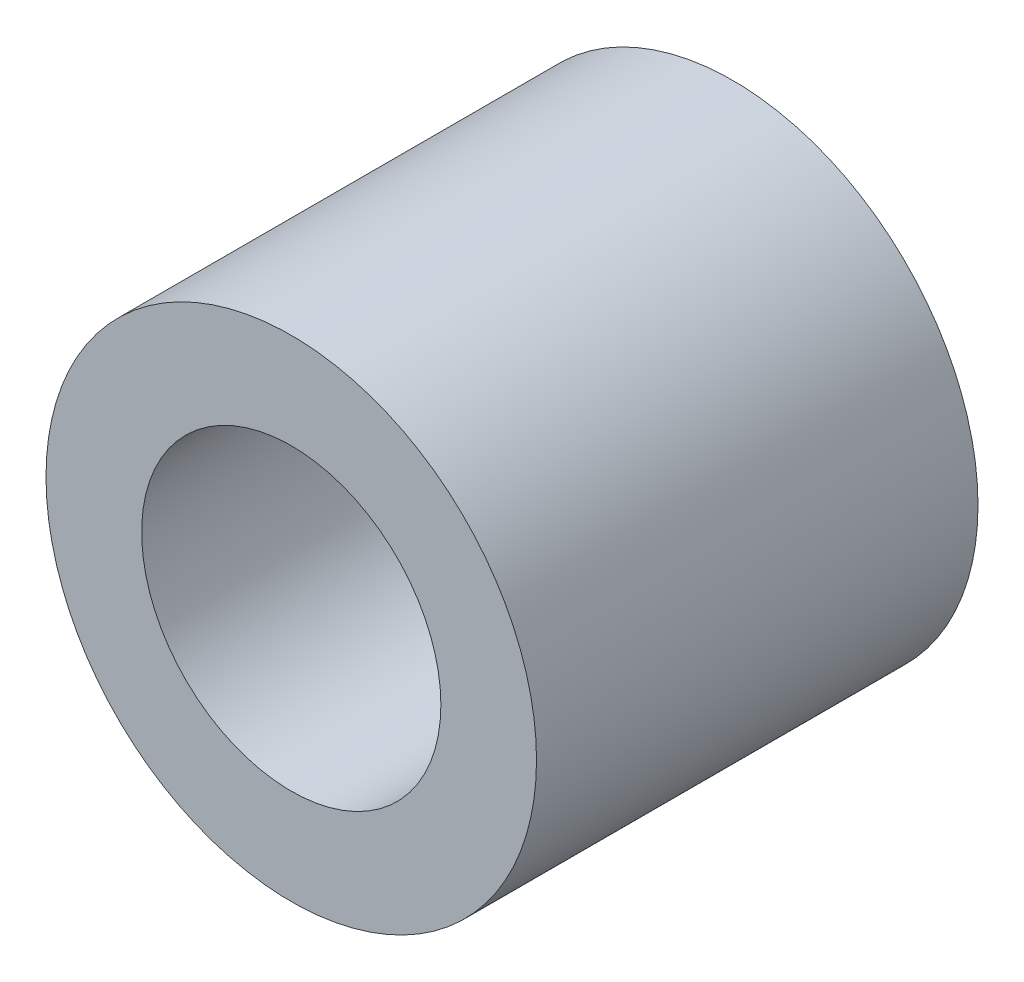
ISO-10303-21;
HEADER;
FILE_DESCRIPTION(('STEP AP214'),'2;1');
FILE_NAME('part.step','',(''),(''),'','','');
FILE_SCHEMA(('AUTOMOTIVE_DESIGN { 1 0 10303 214 1 1 1 1 }'));
ENDSEC;
DATA;
#1=APPLICATION_CONTEXT('core data for automotive mechanical design processes');
#2=APPLICATION_PROTOCOL_DEFINITION('international standard','automotive_design',2000,#1);
#3=PRODUCT_CONTEXT('',#1,'mechanical');
#4=PRODUCT('Part','Part','',(#3));
#5=PRODUCT_RELATED_PRODUCT_CATEGORY('part','',(#4));
#6=PRODUCT_DEFINITION_FORMATION('','',#4);
#7=PRODUCT_DEFINITION_CONTEXT('part definition',#1,'design');
#8=PRODUCT_DEFINITION('design','',#6,#7);
#9=PRODUCT_DEFINITION_SHAPE('','',#8);
#10=(LENGTH_UNIT() NAMED_UNIT(*) SI_UNIT(.MILLI.,.METRE.));
#11=(NAMED_UNIT(*) PLANE_ANGLE_UNIT() SI_UNIT($,.RADIAN.));
#12=(NAMED_UNIT(*) SI_UNIT($,.STERADIAN.) SOLID_ANGLE_UNIT());
#13=UNCERTAINTY_MEASURE_WITH_UNIT(LENGTH_MEASURE(1.E-05),#10,'distance_accuracy_value','');
#14=(GEOMETRIC_REPRESENTATION_CONTEXT(3) GLOBAL_UNCERTAINTY_ASSIGNED_CONTEXT((#13)) GLOBAL_UNIT_ASSIGNED_CONTEXT((#10,
#11,#12)) REPRESENTATION_CONTEXT('',''));
#15=CARTESIAN_POINT('',(0.,0.,0.));
#16=DIRECTION('',(0.,0.,1.));
#17=DIRECTION('',(1.,0.,0.));
#18=AXIS2_PLACEMENT_3D('',#15,#16,#17);
#19=CARTESIAN_POINT('',(0.,0.,9.));
#20=DIRECTION('',(0.,0.,1.));
#21=DIRECTION('',(1.,0.,0.));
#22=AXIS2_PLACEMENT_3D('',#19,#20,#21);
#23=PLANE('',#22);
#24=CARTESIAN_POINT('',(0.,0.,9.));
#25=DIRECTION('',(0.,0.,1.));
#26=DIRECTION('',(1.,0.,0.));
#27=AXIS2_PLACEMENT_3D('',#24,#25,#26);
#28=CIRCLE('',#27,5.);
#29=CARTESIAN_POINT('',(5.,0.,9.));
#30=VERTEX_POINT('',#29);
#31=EDGE_CURVE('E10',#30,#30,#28,.T.);
#32=ORIENTED_EDGE('',*,*,#31,.T.);
#33=EDGE_LOOP('',(#32));
#34=FACE_BOUND('',#33,.T.);
#35=CARTESIAN_POINT('',(0.,0.,9.));
#36=DIRECTION('',(0.,0.,1.));
#37=DIRECTION('',(1.,0.,0.));
#38=AXIS2_PLACEMENT_3D('',#35,#36,#37);
#39=CIRCLE('',#38,3.05);
#40=CARTESIAN_POINT('',(3.05,0.,9.));
#41=VERTEX_POINT('',#40);
#42=EDGE_CURVE('E44',#41,#41,#39,.T.);
#43=ORIENTED_EDGE('',*,*,#42,.F.);
#44=EDGE_LOOP('',(#43));
#45=FACE_BOUND('',#44,.T.);
#46=ADVANCED_FACE('F33',(#34,#45),#23,.T.);
#47=CARTESIAN_POINT('',(0.,0.,0.));
#48=DIRECTION('',(0.,0.,1.));
#49=DIRECTION('',(1.,0.,0.));
#50=AXIS2_PLACEMENT_3D('',#47,#48,#49);
#51=PLANE('',#50);
#52=CARTESIAN_POINT('',(0.,0.,0.));
#53=DIRECTION('',(0.,0.,1.));
#54=DIRECTION('',(1.,0.,0.));
#55=AXIS2_PLACEMENT_3D('',#52,#53,#54);
#56=CIRCLE('',#55,5.);
#57=CARTESIAN_POINT('',(5.,0.,0.));
#58=VERTEX_POINT('',#57);
#59=EDGE_CURVE('E37',#58,#58,#56,.T.);
#60=ORIENTED_EDGE('',*,*,#59,.F.);
#61=EDGE_LOOP('',(#60));
#62=FACE_BOUND('',#61,.T.);
#63=CARTESIAN_POINT('',(0.,0.,0.));
#64=DIRECTION('',(0.,0.,1.));
#65=DIRECTION('',(1.,0.,0.));
#66=AXIS2_PLACEMENT_3D('',#63,#64,#65);
#67=CIRCLE('',#66,3.05);
#68=CARTESIAN_POINT('',(3.05,0.,0.));
#69=VERTEX_POINT('',#68);
#70=EDGE_CURVE('E46',#69,#69,#67,.T.);
#71=ORIENTED_EDGE('',*,*,#70,.T.);
#72=EDGE_LOOP('',(#71));
#73=FACE_BOUND('',#72,.T.);
#74=ADVANCED_FACE('F56',(#62,#73),#51,.F.);
#75=CARTESIAN_POINT('',(0.,0.,9.));
#76=DIRECTION('',(0.,0.,-1.));
#77=DIRECTION('',(-1.,0.,0.));
#78=AXIS2_PLACEMENT_3D('',#75,#76,#77);
#79=CYLINDRICAL_SURFACE('',#78,5.);
#80=ORIENTED_EDGE('',*,*,#31,.F.);
#81=EDGE_LOOP('',(#80));
#82=FACE_BOUND('',#81,.T.);
#83=ORIENTED_EDGE('',*,*,#59,.T.);
#84=EDGE_LOOP('',(#83));
#85=FACE_BOUND('',#84,.T.);
#86=ADVANCED_FACE('F35',(#82,#85),#79,.T.);
#87=CARTESIAN_POINT('',(0.,0.,9.));
#88=DIRECTION('',(0.,0.,-1.));
#89=DIRECTION('',(-1.,0.,0.));
#90=AXIS2_PLACEMENT_3D('',#87,#88,#89);
#91=CYLINDRICAL_SURFACE('',#90,3.05);
#92=ORIENTED_EDGE('',*,*,#42,.T.);
#93=EDGE_LOOP('',(#92));
#94=FACE_BOUND('',#93,.T.);
#95=ORIENTED_EDGE('',*,*,#70,.F.);
#96=EDGE_LOOP('',(#95));
#97=FACE_BOUND('',#96,.T.);
#98=ADVANCED_FACE('F52',(#94,#97),#91,.F.);
#99=CLOSED_SHELL('',(#46,#74,#86,#98));
#100=MANIFOLD_SOLID_BREP('B2',#99);
#101=ADVANCED_BREP_SHAPE_REPRESENTATION('',(#18,#100),#14);
#102=SHAPE_DEFINITION_REPRESENTATION(#9,#101);
ENDSEC;
END-ISO-10303-21;
